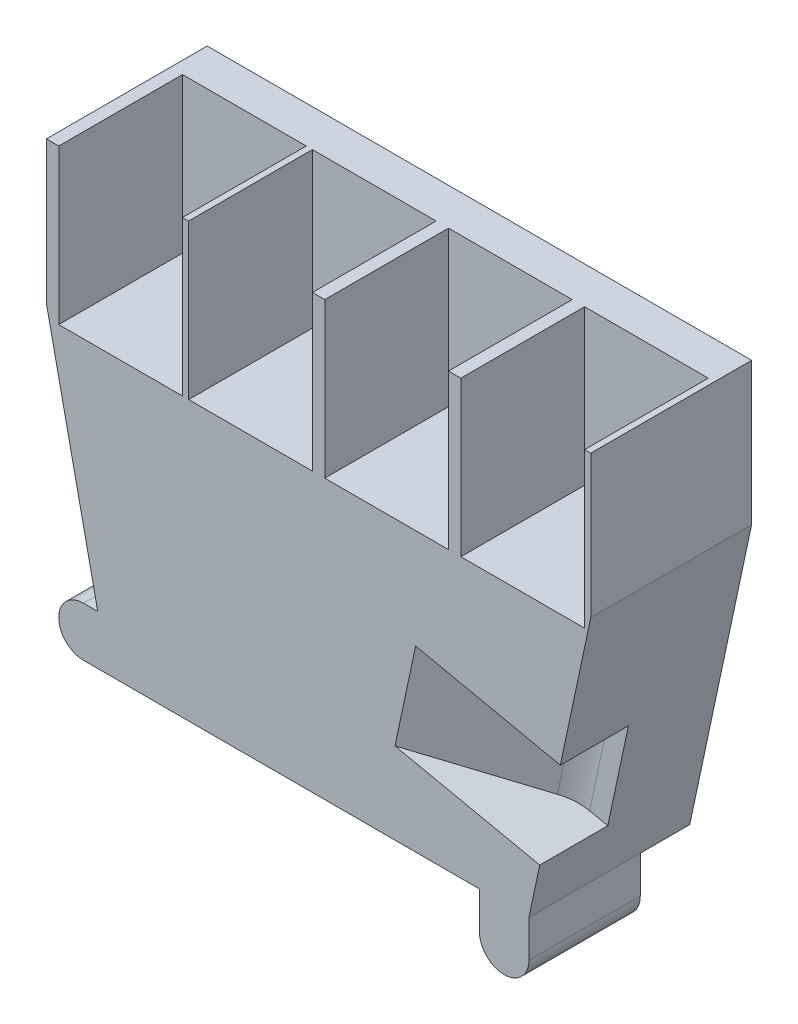
ISO-10303-21;
HEADER;
FILE_DESCRIPTION(('STEP AP214'),'2;1');
FILE_NAME('part.step','',(''),(''),'','','');
FILE_SCHEMA(('AUTOMOTIVE_DESIGN { 1 0 10303 214 1 1 1 1 }'));
ENDSEC;
DATA;
#1=APPLICATION_CONTEXT('core data for automotive mechanical design processes');
#2=APPLICATION_PROTOCOL_DEFINITION('international standard','automotive_design',2000,#1);
#3=PRODUCT_CONTEXT('',#1,'mechanical');
#4=PRODUCT('Part','Part','',(#3));
#5=PRODUCT_RELATED_PRODUCT_CATEGORY('part','',(#4));
#6=PRODUCT_DEFINITION_FORMATION('','',#4);
#7=PRODUCT_DEFINITION_CONTEXT('part definition',#1,'design');
#8=PRODUCT_DEFINITION('design','',#6,#7);
#9=PRODUCT_DEFINITION_SHAPE('','',#8);
#10=(LENGTH_UNIT() NAMED_UNIT(*) SI_UNIT(.MILLI.,.METRE.));
#11=(NAMED_UNIT(*) PLANE_ANGLE_UNIT() SI_UNIT($,.RADIAN.));
#12=(NAMED_UNIT(*) SI_UNIT($,.STERADIAN.) SOLID_ANGLE_UNIT());
#13=UNCERTAINTY_MEASURE_WITH_UNIT(LENGTH_MEASURE(1.E-05),#10,'distance_accuracy_value','');
#14=(GEOMETRIC_REPRESENTATION_CONTEXT(3) GLOBAL_UNCERTAINTY_ASSIGNED_CONTEXT((#13)) GLOBAL_UNIT_ASSIGNED_CONTEXT((#10,
#11,#12)) REPRESENTATION_CONTEXT('',''));
#15=CARTESIAN_POINT('',(0.,0.,0.));
#16=DIRECTION('',(0.,0.,1.));
#17=DIRECTION('',(1.,0.,0.));
#18=AXIS2_PLACEMENT_3D('',#15,#16,#17);
#19=CARTESIAN_POINT('',(26.,-24.,26.));
#20=DIRECTION('',(-1.,0.,0.));
#21=DIRECTION('',(0.,0.,1.));
#22=AXIS2_PLACEMENT_3D('',#19,#20,#21);
#23=PLANE('',#22);
#24=DIRECTION('',(0.,1.,0.));
#25=VECTOR('',#24,1.);
#26=CARTESIAN_POINT('',(26.,-24.,8.));
#27=LINE('',#26,#25);
#28=CARTESIAN_POINT('',(26.,-30.,8.));
#29=VERTEX_POINT('',#28);
#30=CARTESIAN_POINT('',(26.,-24.,8.));
#31=VERTEX_POINT('',#30);
#32=EDGE_CURVE('E419',#29,#31,#27,.T.);
#33=ORIENTED_EDGE('',*,*,#32,.F.);
#34=DIRECTION('',(0.,0.,-1.));
#35=VECTOR('',#34,1.);
#36=CARTESIAN_POINT('',(26.,-30.,26.));
#37=LINE('',#36,#35);
#38=CARTESIAN_POINT('',(26.,-30.,26.));
#39=VERTEX_POINT('',#38);
#40=EDGE_CURVE('E404',#39,#29,#37,.T.);
#41=ORIENTED_EDGE('',*,*,#40,.F.);
#42=DIRECTION('',(0.,1.,0.));
#43=VECTOR('',#42,1.);
#44=CARTESIAN_POINT('',(26.,-24.,26.));
#45=LINE('',#44,#43);
#46=CARTESIAN_POINT('',(26.,-24.,26.));
#47=VERTEX_POINT('',#46);
#48=EDGE_CURVE('E380',#39,#47,#45,.T.);
#49=ORIENTED_EDGE('',*,*,#48,.T.);
#50=DIRECTION('',(0.,0.,-1.));
#51=VECTOR('',#50,1.);
#52=CARTESIAN_POINT('',(26.,-24.,26.));
#53=LINE('',#52,#51);
#54=EDGE_CURVE('E375',#47,#31,#53,.T.);
#55=ORIENTED_EDGE('',*,*,#54,.T.);
#56=EDGE_LOOP('',(#33,#41,#49,#55));
#57=FACE_BOUND('',#56,.T.);
#58=ADVANCED_FACE('F40',(#57),#23,.T.);
#59=CARTESIAN_POINT('',(-34.,-24.,26.));
#60=DIRECTION('',(0.,1.,0.));
#61=DIRECTION('',(0.,0.,1.));
#62=AXIS2_PLACEMENT_3D('',#59,#60,#61);
#63=PLANE('',#62);
#64=DIRECTION('',(0.,0.,-1.));
#65=VECTOR('',#64,1.);
#66=CARTESIAN_POINT('',(-38.,-24.,26.));
#67=LINE('',#66,#65);
#68=CARTESIAN_POINT('',(-38.,-24.,26.));
#69=VERTEX_POINT('',#68);
#70=CARTESIAN_POINT('',(-38.,-24.,0.));
#71=VERTEX_POINT('',#70);
#72=EDGE_CURVE('E259',#69,#71,#67,.T.);
#73=ORIENTED_EDGE('',*,*,#72,.T.);
#74=DIRECTION('',(1.,0.,0.));
#75=VECTOR('',#74,1.);
#76=CARTESIAN_POINT('',(-34.,-24.,0.));
#77=LINE('',#76,#75);
#78=CARTESIAN_POINT('',(34.,-24.,0.));
#79=VERTEX_POINT('',#78);
#80=EDGE_CURVE('E253',#71,#79,#77,.T.);
#81=ORIENTED_EDGE('',*,*,#80,.T.);
#82=DIRECTION('',(0.,0.,1.));
#83=VECTOR('',#82,1.);
#84=CARTESIAN_POINT('',(34.,-24.,0.));
#85=LINE('',#84,#83);
#86=CARTESIAN_POINT('',(34.,-24.,8.));
#87=VERTEX_POINT('',#86);
#88=EDGE_CURVE('E257',#79,#87,#85,.T.);
#89=ORIENTED_EDGE('',*,*,#88,.T.);
#90=DIRECTION('',(1.,0.,0.));
#91=VECTOR('',#90,1.);
#92=CARTESIAN_POINT('',(-44.,-24.,8.));
#93=LINE('',#92,#91);
#94=EDGE_CURVE('E422',#31,#87,#93,.T.);
#95=ORIENTED_EDGE('',*,*,#94,.F.);
#96=ORIENTED_EDGE('',*,*,#54,.F.);
#97=DIRECTION('',(1.,0.,0.));
#98=VECTOR('',#97,1.);
#99=CARTESIAN_POINT('',(-34.,-24.,26.));
#100=LINE('',#99,#98);
#101=EDGE_CURVE('E597',#69,#47,#100,.T.);
#102=ORIENTED_EDGE('',*,*,#101,.F.);
#103=EDGE_LOOP('',(#73,#81,#89,#95,#96,#102));
#104=FACE_BOUND('',#103,.T.);
#105=ADVANCED_FACE('F255',(#104),#63,.F.);
#106=CARTESIAN_POINT('',(32.8135538420826,-15.1606804101311,22.999075159608));
#107=DIRECTION('',(0.208107644464858,0.978105928984836,0.));
#108=DIRECTION('',(-0.978105928984836,0.208107644464858,0.));
#109=AXIS2_PLACEMENT_3D('',#106,#107,#108);
#110=CYLINDRICAL_SURFACE('',#109,8.);
#111=DIRECTION('',(0.208107644464858,0.978105928984836,0.));
#112=VECTOR('',#111,1.);
#113=CARTESIAN_POINT('',(28.7579721450863,-14.2977906873236,16.1574614299926));
#114=LINE('',#113,#112);
#115=CARTESIAN_POINT('',(28.7579721450831,-14.2977906873381,16.1574614299927));
#116=VERTEX_POINT('',#115);
#117=CARTESIAN_POINT('',(32.0876944516157,1.35190417746291,16.157461433032));
#118=VERTEX_POINT('',#117);
#119=EDGE_CURVE('E49',#116,#118,#114,.T.);
#120=ORIENTED_EDGE('',*,*,#119,.F.);
#121=CARTESIAN_POINT('',(32.8135538420826,-15.1606804101311,22.999075159608));
#122=DIRECTION('',(0.208107644464858,0.978105928984836,6.86560183704721E-12));
#123=DIRECTION('',(-0.978105928984836,0.208107644464858,0.));
#124=AXIS2_PLACEMENT_3D('',#121,#122,#123);
#125=CIRCLE('',#124,8.);
#126=CARTESIAN_POINT('',(32.813553842094,-15.1606804100774,14.999075159608));
#127=VERTEX_POINT('',#126);
#128=EDGE_CURVE('E348',#127,#116,#125,.T.);
#129=ORIENTED_EDGE('',*,*,#128,.F.);
#130=DIRECTION('',(0.208107644464858,0.978105928984836,0.));
#131=VECTOR('',#130,1.);
#132=CARTESIAN_POINT('',(32.813553842094,-15.1606804100774,14.999075159608));
#133=LINE('',#132,#131);
#134=CARTESIAN_POINT('',(36.1432761535318,0.489014453679986,14.999075159608));
#135=VERTEX_POINT('',#134);
#136=EDGE_CURVE('E346',#127,#135,#133,.T.);
#137=ORIENTED_EDGE('',*,*,#136,.T.);
#138=CARTESIAN_POINT('',(36.1432761535203,0.489014453626261,22.999075159608));
#139=DIRECTION('',(0.208107644464858,0.978105928984836,6.86560183704721E-12));
#140=DIRECTION('',(-0.978105928984836,0.208107644464858,0.));
#141=AXIS2_PLACEMENT_3D('',#138,#139,#140);
#142=CIRCLE('',#141,8.);
#143=EDGE_CURVE('E338',#135,#118,#142,.T.);
#144=ORIENTED_EDGE('',*,*,#143,.T.);
#145=EDGE_LOOP('',(#120,#129,#137,#144));
#146=FACE_BOUND('',#145,.T.);
#147=ADVANCED_FACE('F344',(#146),#110,.F.);
#148=CARTESIAN_POINT('',(-44.,46.,26.));
#149=DIRECTION('',(1.,0.,0.));
#150=DIRECTION('',(0.,1.,0.));
#151=AXIS2_PLACEMENT_3D('',#148,#149,#150);
#152=PLANE('',#151);
#153=DIRECTION('',(0.,-1.,0.));
#154=VECTOR('',#153,1.);
#155=CARTESIAN_POINT('',(-44.,46.,0.));
#156=LINE('',#155,#154);
#157=CARTESIAN_POINT('',(-44.,46.,0.));
#158=VERTEX_POINT('',#157);
#159=CARTESIAN_POINT('',(-44.,23.,0.));
#160=VERTEX_POINT('',#159);
#161=EDGE_CURVE('E465',#158,#160,#156,.T.);
#162=ORIENTED_EDGE('',*,*,#161,.T.);
#163=DIRECTION('',(0.,0.,-1.));
#164=VECTOR('',#163,1.);
#165=CARTESIAN_POINT('',(-44.,23.,26.));
#166=LINE('',#165,#164);
#167=CARTESIAN_POINT('',(-44.,23.,26.));
#168=VERTEX_POINT('',#167);
#169=EDGE_CURVE('E306',#168,#160,#166,.T.);
#170=ORIENTED_EDGE('',*,*,#169,.F.);
#171=DIRECTION('',(0.,-1.,0.));
#172=VECTOR('',#171,1.);
#173=CARTESIAN_POINT('',(-44.,46.,26.));
#174=LINE('',#173,#172);
#175=CARTESIAN_POINT('',(-44.,46.,26.));
#176=VERTEX_POINT('',#175);
#177=EDGE_CURVE('E291',#176,#168,#174,.T.);
#178=ORIENTED_EDGE('',*,*,#177,.F.);
#179=DIRECTION('',(0.,0.,-1.));
#180=VECTOR('',#179,1.);
#181=CARTESIAN_POINT('',(-44.,46.,26.));
#182=LINE('',#181,#180);
#183=EDGE_CURVE('E292',#176,#158,#182,.T.);
#184=ORIENTED_EDGE('',*,*,#183,.T.);
#185=EDGE_LOOP('',(#162,#170,#178,#184));
#186=FACE_BOUND('',#185,.T.);
#187=ADVANCED_FACE('F42',(#186),#152,.F.);
#188=CARTESIAN_POINT('',(-44.,23.,26.));
#189=DIRECTION('',(0.978105928984836,0.208107644464859,0.));
#190=DIRECTION('',(-0.208107644464859,0.978105928984836,0.));
#191=AXIS2_PLACEMENT_3D('',#188,#189,#190);
#192=PLANE('',#191);
#193=DIRECTION('',(0.208107644464859,-0.978105928984835,0.));
#194=VECTOR('',#193,1.);
#195=CARTESIAN_POINT('',(-44.,23.,0.));
#196=LINE('',#195,#194);
#197=CARTESIAN_POINT('',(-35.7021276595745,-16.,0.));
#198=VERTEX_POINT('',#197);
#199=EDGE_CURVE('E266',#160,#198,#196,.T.);
#200=ORIENTED_EDGE('',*,*,#199,.T.);
#201=DIRECTION('',(0.,0.,1.));
#202=VECTOR('',#201,1.);
#203=CARTESIAN_POINT('',(-35.7021276595745,-16.,26.));
#204=LINE('',#203,#202);
#205=CARTESIAN_POINT('',(-35.7021276595745,-16.,26.));
#206=VERTEX_POINT('',#205);
#207=EDGE_CURVE('E387',#198,#206,#204,.T.);
#208=ORIENTED_EDGE('',*,*,#207,.T.);
#209=DIRECTION('',(0.208107644464859,-0.978105928984835,0.));
#210=VECTOR('',#209,1.);
#211=CARTESIAN_POINT('',(-44.,23.,26.));
#212=LINE('',#211,#210);
#213=EDGE_CURVE('E593',#168,#206,#212,.T.);
#214=ORIENTED_EDGE('',*,*,#213,.F.);
#215=ORIENTED_EDGE('',*,*,#169,.T.);
#216=EDGE_LOOP('',(#200,#208,#214,#215));
#217=FACE_BOUND('',#216,.T.);
#218=ADVANCED_FACE('F619',(#217),#192,.F.);
#219=CARTESIAN_POINT('',(34.,-24.,26.));
#220=DIRECTION('',(-0.978105928984836,0.208107644464858,0.));
#221=DIRECTION('',(-0.208107644464858,-0.978105928984836,0.));
#222=AXIS2_PLACEMENT_3D('',#219,#220,#221);
#223=PLANE('',#222);
#224=DIRECTION('',(0.208107644464858,0.978105928984836,0.));
#225=VECTOR('',#224,1.);
#226=CARTESIAN_POINT('',(34.,-24.,26.));
#227=LINE('',#226,#225);
#228=CARTESIAN_POINT('',(39.0775939404677,-0.13530847980171,26.));
#229=VERTEX_POINT('',#228);
#230=CARTESIAN_POINT('',(44.,23.,26.));
#231=VERTEX_POINT('',#230);
#232=EDGE_CURVE('E601',#229,#231,#227,.T.);
#233=ORIENTED_EDGE('',*,*,#232,.F.);
#234=DIRECTION('',(1.10229687708396E-12,5.1807953222946E-12,-1.));
#235=VECTOR('',#234,1.);
#236=CARTESIAN_POINT('',(39.0775939404677,-0.135308479801709,26.0000000001292));
#237=LINE('',#236,#235);
#238=CARTESIAN_POINT('',(39.0775939404863,-0.135308479714585,14.999075159608));
#239=VERTEX_POINT('',#238);
#240=EDGE_CURVE('E429',#229,#239,#237,.T.);
#241=ORIENTED_EDGE('',*,*,#240,.T.);
#242=DIRECTION('',(-0.208107644464858,-0.978105928984836,0.));
#243=VECTOR('',#242,1.);
#244=CARTESIAN_POINT('',(34.,-24.,14.999075159608));
#245=LINE('',#244,#243);
#246=CARTESIAN_POINT('',(35.7478716290485,-15.785003343472,14.999075159608));
#247=VERTEX_POINT('',#246);
#248=EDGE_CURVE('E316',#239,#247,#245,.T.);
#249=ORIENTED_EDGE('',*,*,#248,.T.);
#250=DIRECTION('',(1.10229687708396E-12,5.1807953222946E-12,-1.));
#251=VECTOR('',#250,1.);
#252=CARTESIAN_POINT('',(35.74787162903,-15.7850033435591,26.0000000000445));
#253=LINE('',#252,#251);
#254=CARTESIAN_POINT('',(35.74787162903,-15.7850033435591,26.));
#255=VERTEX_POINT('',#254);
#256=EDGE_CURVE('E352',#255,#247,#253,.T.);
#257=ORIENTED_EDGE('',*,*,#256,.F.);
#258=CARTESIAN_POINT('',(34.,-24.,26.));
#259=VERTEX_POINT('',#258);
#260=EDGE_CURVE('E602',#259,#255,#227,.T.);
#261=ORIENTED_EDGE('',*,*,#260,.F.);
#262=DIRECTION('',(0.,0.,-1.));
#263=VECTOR('',#262,1.);
#264=CARTESIAN_POINT('',(34.,-24.,26.));
#265=LINE('',#264,#263);
#266=EDGE_CURVE('E275',#259,#87,#265,.T.);
#267=ORIENTED_EDGE('',*,*,#266,.T.);
#268=ORIENTED_EDGE('',*,*,#88,.F.);
#269=DIRECTION('',(0.208107644464858,0.978105928984836,0.));
#270=VECTOR('',#269,1.);
#271=CARTESIAN_POINT('',(34.,-24.,0.));
#272=LINE('',#271,#270);
#273=CARTESIAN_POINT('',(44.,23.,0.));
#274=VERTEX_POINT('',#273);
#275=EDGE_CURVE('E265',#79,#274,#272,.T.);
#276=ORIENTED_EDGE('',*,*,#275,.T.);
#277=DIRECTION('',(0.,0.,-1.));
#278=VECTOR('',#277,1.);
#279=CARTESIAN_POINT('',(44.,23.,26.));
#280=LINE('',#279,#278);
#281=EDGE_CURVE('E301',#231,#274,#280,.T.);
#282=ORIENTED_EDGE('',*,*,#281,.F.);
#283=EDGE_LOOP('',(#233,#241,#249,#257,#261,#267,#268,#276,#282));
#284=FACE_BOUND('',#283,.T.);
#285=ADVANCED_FACE('F271',(#284),#223,.F.);
#286=CARTESIAN_POINT('',(44.,46.,26.));
#287=DIRECTION('',(-1.,0.,0.));
#288=DIRECTION('',(0.,-1.,0.));
#289=AXIS2_PLACEMENT_3D('',#286,#287,#288);
#290=PLANE('',#289);
#291=DIRECTION('',(0.,1.,0.));
#292=VECTOR('',#291,1.);
#293=CARTESIAN_POINT('',(44.,46.,0.));
#294=LINE('',#293,#292);
#295=CARTESIAN_POINT('',(44.,46.,0.));
#296=VERTEX_POINT('',#295);
#297=EDGE_CURVE('E281',#274,#296,#294,.T.);
#298=ORIENTED_EDGE('',*,*,#297,.T.);
#299=DIRECTION('',(0.,0.,-1.));
#300=VECTOR('',#299,1.);
#301=CARTESIAN_POINT('',(44.,46.,26.));
#302=LINE('',#301,#300);
#303=CARTESIAN_POINT('',(44.,46.,26.));
#304=VERTEX_POINT('',#303);
#305=EDGE_CURVE('E296',#304,#296,#302,.T.);
#306=ORIENTED_EDGE('',*,*,#305,.F.);
#307=DIRECTION('',(0.,1.,0.));
#308=VECTOR('',#307,1.);
#309=CARTESIAN_POINT('',(44.,46.,26.));
#310=LINE('',#309,#308);
#311=EDGE_CURVE('E606',#231,#304,#310,.T.);
#312=ORIENTED_EDGE('',*,*,#311,.F.);
#313=ORIENTED_EDGE('',*,*,#281,.T.);
#314=EDGE_LOOP('',(#298,#306,#312,#313));
#315=FACE_BOUND('',#314,.T.);
#316=ADVANCED_FACE('F643',(#315),#290,.F.);
#317=CARTESIAN_POINT('',(-44.,46.,26.));
#318=DIRECTION('',(0.,-1.,0.));
#319=DIRECTION('',(0.,0.,-1.));
#320=AXIS2_PLACEMENT_3D('',#317,#318,#319);
#321=PLANE('',#320);
#322=DIRECTION('',(-1.,0.,0.));
#323=VECTOR('',#322,1.);
#324=CARTESIAN_POINT('',(43.,46.,6.));
#325=LINE('',#324,#323);
#326=CARTESIAN_POINT('',(43.,46.,6.));
#327=VERTEX_POINT('',#326);
#328=CARTESIAN_POINT('',(23.,46.,6.));
#329=VERTEX_POINT('',#328);
#330=EDGE_CURVE('E455',#327,#329,#325,.T.);
#331=ORIENTED_EDGE('',*,*,#330,.F.);
#332=DIRECTION('',(0.,0.,-1.));
#333=VECTOR('',#332,1.);
#334=CARTESIAN_POINT('',(43.,46.,26.));
#335=LINE('',#334,#333);
#336=CARTESIAN_POINT('',(43.,46.,26.));
#337=VERTEX_POINT('',#336);
#338=EDGE_CURVE('E451',#337,#327,#335,.T.);
#339=ORIENTED_EDGE('',*,*,#338,.F.);
#340=DIRECTION('',(-1.,0.,0.));
#341=VECTOR('',#340,1.);
#342=CARTESIAN_POINT('',(-44.,46.,26.));
#343=LINE('',#342,#341);
#344=EDGE_CURVE('E297',#304,#337,#343,.T.);
#345=ORIENTED_EDGE('',*,*,#344,.F.);
#346=ORIENTED_EDGE('',*,*,#305,.T.);
#347=DIRECTION('',(-1.,0.,0.));
#348=VECTOR('',#347,1.);
#349=CARTESIAN_POINT('',(-44.,46.,0.));
#350=LINE('',#349,#348);
#351=EDGE_CURVE('E285',#296,#158,#350,.T.);
#352=ORIENTED_EDGE('',*,*,#351,.T.);
#353=ORIENTED_EDGE('',*,*,#183,.F.);
#354=CARTESIAN_POINT('',(-42.,46.,26.));
#355=VERTEX_POINT('',#354);
#356=EDGE_CURVE('E609',#355,#176,#343,.T.);
#357=ORIENTED_EDGE('',*,*,#356,.F.);
#358=DIRECTION('',(0.,0.,1.));
#359=VECTOR('',#358,1.);
#360=CARTESIAN_POINT('',(-42.,46.,26.));
#361=LINE('',#360,#359);
#362=CARTESIAN_POINT('',(-42.,46.,6.));
#363=VERTEX_POINT('',#362);
#364=EDGE_CURVE('E558',#363,#355,#361,.T.);
#365=ORIENTED_EDGE('',*,*,#364,.F.);
#366=DIRECTION('',(-1.,0.,0.));
#367=VECTOR('',#366,1.);
#368=CARTESIAN_POINT('',(-22.,46.,6.));
#369=LINE('',#368,#367);
#370=CARTESIAN_POINT('',(-22.,46.,6.));
#371=VERTEX_POINT('',#370);
#372=EDGE_CURVE('E573',#371,#363,#369,.T.);
#373=ORIENTED_EDGE('',*,*,#372,.F.);
#374=DIRECTION('',(0.,0.,-1.));
#375=VECTOR('',#374,1.);
#376=CARTESIAN_POINT('',(-22.,46.,26.));
#377=LINE('',#376,#375);
#378=CARTESIAN_POINT('',(-22.,46.,26.));
#379=VERTEX_POINT('',#378);
#380=EDGE_CURVE('E433',#379,#371,#377,.T.);
#381=ORIENTED_EDGE('',*,*,#380,.F.);
#382=CARTESIAN_POINT('',(-21.,46.,26.));
#383=VERTEX_POINT('',#382);
#384=EDGE_CURVE('E647',#383,#379,#343,.T.);
#385=ORIENTED_EDGE('',*,*,#384,.F.);
#386=DIRECTION('',(0.,0.,1.));
#387=VECTOR('',#386,1.);
#388=CARTESIAN_POINT('',(-21.,46.,26.));
#389=LINE('',#388,#387);
#390=CARTESIAN_POINT('',(-21.,46.,6.));
#391=VERTEX_POINT('',#390);
#392=EDGE_CURVE('E519',#391,#383,#389,.T.);
#393=ORIENTED_EDGE('',*,*,#392,.F.);
#394=DIRECTION('',(-1.,0.,0.));
#395=VECTOR('',#394,1.);
#396=CARTESIAN_POINT('',(-1.00000000000001,46.,6.));
#397=LINE('',#396,#395);
#398=CARTESIAN_POINT('',(-1.00000000000001,46.,6.));
#399=VERTEX_POINT('',#398);
#400=EDGE_CURVE('E535',#399,#391,#397,.T.);
#401=ORIENTED_EDGE('',*,*,#400,.F.);
#402=DIRECTION('',(0.,0.,-1.));
#403=VECTOR('',#402,1.);
#404=CARTESIAN_POINT('',(-1.00000000000001,46.,26.));
#405=LINE('',#404,#403);
#406=CARTESIAN_POINT('',(-1.00000000000001,46.,26.));
#407=VERTEX_POINT('',#406);
#408=EDGE_CURVE('E531',#407,#399,#405,.T.);
#409=ORIENTED_EDGE('',*,*,#408,.F.);
#410=CARTESIAN_POINT('',(0.999999999999987,46.,26.));
#411=VERTEX_POINT('',#410);
#412=EDGE_CURVE('E650',#411,#407,#343,.T.);
#413=ORIENTED_EDGE('',*,*,#412,.F.);
#414=DIRECTION('',(0.,0.,1.));
#415=VECTOR('',#414,1.);
#416=CARTESIAN_POINT('',(0.999999999999987,46.,26.));
#417=LINE('',#416,#415);
#418=CARTESIAN_POINT('',(0.999999999999987,46.,6.));
#419=VERTEX_POINT('',#418);
#420=EDGE_CURVE('E480',#419,#411,#417,.T.);
#421=ORIENTED_EDGE('',*,*,#420,.F.);
#422=DIRECTION('',(-1.,0.,0.));
#423=VECTOR('',#422,1.);
#424=CARTESIAN_POINT('',(21.,46.,6.));
#425=LINE('',#424,#423);
#426=CARTESIAN_POINT('',(21.,46.,6.));
#427=VERTEX_POINT('',#426);
#428=EDGE_CURVE('E496',#427,#419,#425,.T.);
#429=ORIENTED_EDGE('',*,*,#428,.F.);
#430=DIRECTION('',(0.,0.,-1.));
#431=VECTOR('',#430,1.);
#432=CARTESIAN_POINT('',(21.,46.,26.));
#433=LINE('',#432,#431);
#434=CARTESIAN_POINT('',(21.,46.,26.));
#435=VERTEX_POINT('',#434);
#436=EDGE_CURVE('E492',#435,#427,#433,.T.);
#437=ORIENTED_EDGE('',*,*,#436,.F.);
#438=CARTESIAN_POINT('',(23.,46.,26.));
#439=VERTEX_POINT('',#438);
#440=EDGE_CURVE('E613',#439,#435,#343,.T.);
#441=ORIENTED_EDGE('',*,*,#440,.F.);
#442=DIRECTION('',(0.,0.,1.));
#443=VECTOR('',#442,1.);
#444=CARTESIAN_POINT('',(23.,46.,26.));
#445=LINE('',#444,#443);
#446=EDGE_CURVE('E439',#329,#439,#445,.T.);
#447=ORIENTED_EDGE('',*,*,#446,.F.);
#448=EDGE_LOOP('',(#331,#339,#345,#346,#352,#353,#357,#365,#373,#381,#385,#393,#401,#409,#413,
#421,#429,#437,#441,#447));
#449=FACE_BOUND('',#448,.T.);
#450=ADVANCED_FACE('F637',(#449),#321,.F.);
#451=CARTESIAN_POINT('',(0.,0.,26.));
#452=DIRECTION('',(0.,0.,1.));
#453=DIRECTION('',(1.,0.,0.));
#454=AXIS2_PLACEMENT_3D('',#451,#452,#453);
#455=PLANE('',#454);
#456=CARTESIAN_POINT('',(30.,-30.,26.));
#457=DIRECTION('',(0.,0.,1.));
#458=DIRECTION('',(-1.,0.,0.));
#459=AXIS2_PLACEMENT_3D('',#456,#457,#458);
#460=CIRCLE('',#459,4.);
#461=CARTESIAN_POINT('',(34.,-30.,26.));
#462=VERTEX_POINT('',#461);
#463=EDGE_CURVE('E63',#39,#462,#460,.T.);
#464=ORIENTED_EDGE('',*,*,#463,.T.);
#465=DIRECTION('',(0.,-1.,0.));
#466=VECTOR('',#465,1.);
#467=CARTESIAN_POINT('',(34.,-24.,26.));
#468=LINE('',#467,#466);
#469=EDGE_CURVE('E383',#259,#462,#468,.T.);
#470=ORIENTED_EDGE('',*,*,#469,.F.);
#471=ORIENTED_EDGE('',*,*,#260,.T.);
#472=DIRECTION('',(-0.978105928984586,0.208107644466032,0.));
#473=VECTOR('',#472,1.);
#474=CARTESIAN_POINT('',(-1.66486115572516,-7.82484743186214,26.));
#475=LINE('',#474,#473);
#476=CARTESIAN_POINT('',(12.3549028544952,-10.8077759446926,26.0000000000714));
#477=VERTEX_POINT('',#476);
#478=EDGE_CURVE('E310',#255,#477,#475,.T.);
#479=ORIENTED_EDGE('',*,*,#478,.T.);
#480=DIRECTION('',(-0.208107644466032,-0.978105928984586,-5.29676302818416E-12));
#481=VECTOR('',#480,1.);
#482=CARTESIAN_POINT('',(15.6846251659517,4.8419189190608,26.0000000001562));
#483=LINE('',#482,#481);
#484=CARTESIAN_POINT('',(15.6846251659517,4.8419189190608,26.0000000001562));
#485=VERTEX_POINT('',#484);
#486=EDGE_CURVE('E341',#485,#477,#483,.T.);
#487=ORIENTED_EDGE('',*,*,#486,.F.);
#488=DIRECTION('',(-0.978105928984586,0.208107644466032,0.));
#489=VECTOR('',#488,1.);
#490=CARTESIAN_POINT('',(1.66486115573135,7.82484743189123,26.));
#491=LINE('',#490,#489);
#492=EDGE_CURVE('E313',#229,#485,#491,.T.);
#493=ORIENTED_EDGE('',*,*,#492,.F.);
#494=ORIENTED_EDGE('',*,*,#232,.T.);
#495=ORIENTED_EDGE('',*,*,#311,.T.);
#496=ORIENTED_EDGE('',*,*,#344,.T.);
#497=DIRECTION('',(0.,1.,0.));
#498=VECTOR('',#497,1.);
#499=CARTESIAN_POINT('',(43.,21.,26.));
#500=LINE('',#499,#498);
#501=CARTESIAN_POINT('',(43.,21.,26.));
#502=VERTEX_POINT('',#501);
#503=EDGE_CURVE('E462',#502,#337,#500,.T.);
#504=ORIENTED_EDGE('',*,*,#503,.F.);
#505=DIRECTION('',(1.,0.,0.));
#506=VECTOR('',#505,1.);
#507=CARTESIAN_POINT('',(43.,21.,26.));
#508=LINE('',#507,#506);
#509=CARTESIAN_POINT('',(23.,21.,26.));
#510=VERTEX_POINT('',#509);
#511=EDGE_CURVE('E446',#510,#502,#508,.T.);
#512=ORIENTED_EDGE('',*,*,#511,.F.);
#513=DIRECTION('',(0.,1.,0.));
#514=VECTOR('',#513,1.);
#515=CARTESIAN_POINT('',(23.,21.,26.));
#516=LINE('',#515,#514);
#517=EDGE_CURVE('E466',#510,#439,#516,.T.);
#518=ORIENTED_EDGE('',*,*,#517,.T.);
#519=ORIENTED_EDGE('',*,*,#440,.T.);
#520=DIRECTION('',(0.,1.,0.));
#521=VECTOR('',#520,1.);
#522=CARTESIAN_POINT('',(21.,21.,26.));
#523=LINE('',#522,#521);
#524=CARTESIAN_POINT('',(21.,21.,26.));
#525=VERTEX_POINT('',#524);
#526=EDGE_CURVE('E456',#525,#435,#523,.T.);
#527=ORIENTED_EDGE('',*,*,#526,.F.);
#528=DIRECTION('',(1.,0.,0.));
#529=VECTOR('',#528,1.);
#530=CARTESIAN_POINT('',(21.,21.,26.));
#531=LINE('',#530,#529);
#532=CARTESIAN_POINT('',(0.999999999999987,21.,26.));
#533=VERTEX_POINT('',#532);
#534=EDGE_CURVE('E487',#533,#525,#531,.T.);
#535=ORIENTED_EDGE('',*,*,#534,.F.);
#536=DIRECTION('',(0.,1.,0.));
#537=VECTOR('',#536,1.);
#538=CARTESIAN_POINT('',(0.999999999999987,21.,26.));
#539=LINE('',#538,#537);
#540=EDGE_CURVE('E505',#533,#411,#539,.T.);
#541=ORIENTED_EDGE('',*,*,#540,.T.);
#542=ORIENTED_EDGE('',*,*,#412,.T.);
#543=DIRECTION('',(0.,1.,0.));
#544=VECTOR('',#543,1.);
#545=CARTESIAN_POINT('',(-1.00000000000001,21.,26.));
#546=LINE('',#545,#544);
#547=CARTESIAN_POINT('',(-1.00000000000001,21.,26.));
#548=VERTEX_POINT('',#547);
#549=EDGE_CURVE('E497',#548,#407,#546,.T.);
#550=ORIENTED_EDGE('',*,*,#549,.F.);
#551=DIRECTION('',(1.,0.,0.));
#552=VECTOR('',#551,1.);
#553=CARTESIAN_POINT('',(-1.00000000000001,21.,26.));
#554=LINE('',#553,#552);
#555=CARTESIAN_POINT('',(-21.,21.,26.));
#556=VERTEX_POINT('',#555);
#557=EDGE_CURVE('E526',#556,#548,#554,.T.);
#558=ORIENTED_EDGE('',*,*,#557,.F.);
#559=DIRECTION('',(0.,1.,0.));
#560=VECTOR('',#559,1.);
#561=CARTESIAN_POINT('',(-21.,21.,26.));
#562=LINE('',#561,#560);
#563=EDGE_CURVE('E544',#556,#383,#562,.T.);
#564=ORIENTED_EDGE('',*,*,#563,.T.);
#565=ORIENTED_EDGE('',*,*,#384,.T.);
#566=DIRECTION('',(0.,1.,0.));
#567=VECTOR('',#566,1.);
#568=CARTESIAN_POINT('',(-22.,21.,26.));
#569=LINE('',#568,#567);
#570=CARTESIAN_POINT('',(-22.,21.,26.));
#571=VERTEX_POINT('',#570);
#572=EDGE_CURVE('E536',#571,#379,#569,.T.);
#573=ORIENTED_EDGE('',*,*,#572,.F.);
#574=DIRECTION('',(1.,0.,0.));
#575=VECTOR('',#574,1.);
#576=CARTESIAN_POINT('',(-22.,21.,26.));
#577=LINE('',#576,#575);
#578=CARTESIAN_POINT('',(-42.,21.,26.));
#579=VERTEX_POINT('',#578);
#580=EDGE_CURVE('E565',#579,#571,#577,.T.);
#581=ORIENTED_EDGE('',*,*,#580,.F.);
#582=DIRECTION('',(0.,1.,0.));
#583=VECTOR('',#582,1.);
#584=CARTESIAN_POINT('',(-42.,21.,26.));
#585=LINE('',#584,#583);
#586=EDGE_CURVE('E581',#579,#355,#585,.T.);
#587=ORIENTED_EDGE('',*,*,#586,.T.);
#588=ORIENTED_EDGE('',*,*,#356,.T.);
#589=ORIENTED_EDGE('',*,*,#177,.T.);
#590=ORIENTED_EDGE('',*,*,#213,.T.);
#591=DIRECTION('',(1.,0.,0.));
#592=VECTOR('',#591,1.);
#593=CARTESIAN_POINT('',(-34.,-16.,26.));
#594=LINE('',#593,#592);
#595=CARTESIAN_POINT('',(-38.,-16.,26.));
#596=VERTEX_POINT('',#595);
#597=EDGE_CURVE('E393',#596,#206,#594,.T.);
#598=ORIENTED_EDGE('',*,*,#597,.F.);
#599=CARTESIAN_POINT('',(-38.,-20.,26.));
#600=DIRECTION('',(0.,0.,-1.));
#601=DIRECTION('',(-1.,0.,0.));
#602=AXIS2_PLACEMENT_3D('',#599,#600,#601);
#603=CIRCLE('',#602,4.);
#604=EDGE_CURVE('E400',#69,#596,#603,.T.);
#605=ORIENTED_EDGE('',*,*,#604,.F.);
#606=ORIENTED_EDGE('',*,*,#101,.T.);
#607=ORIENTED_EDGE('',*,*,#48,.F.);
#608=EDGE_LOOP('',(#464,#470,#471,#479,#487,#493,#494,#495,#496,#504,#512,#518,#519,#527,#535,
#541,#542,#550,#558,#564,#565,#573,#581,#587,#588,#589,#590,#598,#605,#606,#607));
#609=FACE_BOUND('',#608,.T.);
#610=ADVANCED_FACE('F630',(#609),#455,.T.);
#611=CARTESIAN_POINT('',(0.,0.,0.));
#612=DIRECTION('',(0.,0.,1.));
#613=DIRECTION('',(1.,0.,0.));
#614=AXIS2_PLACEMENT_3D('',#611,#612,#613);
#615=PLANE('',#614);
#616=ORIENTED_EDGE('',*,*,#275,.F.);
#617=ORIENTED_EDGE('',*,*,#80,.F.);
#618=CARTESIAN_POINT('',(-38.,-20.,0.));
#619=DIRECTION('',(0.,0.,-1.));
#620=DIRECTION('',(-1.,0.,0.));
#621=AXIS2_PLACEMENT_3D('',#618,#619,#620);
#622=CIRCLE('',#621,4.);
#623=CARTESIAN_POINT('',(-38.,-16.,0.));
#624=VERTEX_POINT('',#623);
#625=EDGE_CURVE('E401',#71,#624,#622,.T.);
#626=ORIENTED_EDGE('',*,*,#625,.T.);
#627=DIRECTION('',(1.,0.,0.));
#628=VECTOR('',#627,1.);
#629=CARTESIAN_POINT('',(-34.,-16.,0.));
#630=LINE('',#629,#628);
#631=EDGE_CURVE('E396',#624,#198,#630,.T.);
#632=ORIENTED_EDGE('',*,*,#631,.T.);
#633=ORIENTED_EDGE('',*,*,#199,.F.);
#634=ORIENTED_EDGE('',*,*,#161,.F.);
#635=ORIENTED_EDGE('',*,*,#351,.F.);
#636=ORIENTED_EDGE('',*,*,#297,.F.);
#637=EDGE_LOOP('',(#616,#617,#626,#632,#633,#634,#635,#636));
#638=FACE_BOUND('',#637,.T.);
#639=ADVANCED_FACE('F279',(#638),#615,.F.);
#640=CARTESIAN_POINT('',(-22.,21.,26.));
#641=DIRECTION('',(1.,0.,0.));
#642=DIRECTION('',(0.,0.,-1.));
#643=AXIS2_PLACEMENT_3D('',#640,#641,#642);
#644=PLANE('',#643);
#645=ORIENTED_EDGE('',*,*,#380,.T.);
#646=DIRECTION('',(0.,1.,0.));
#647=VECTOR('',#646,1.);
#648=CARTESIAN_POINT('',(-22.,21.,6.));
#649=LINE('',#648,#647);
#650=CARTESIAN_POINT('',(-22.,21.,6.));
#651=VERTEX_POINT('',#650);
#652=EDGE_CURVE('E569',#651,#371,#649,.T.);
#653=ORIENTED_EDGE('',*,*,#652,.F.);
#654=DIRECTION('',(0.,0.,-1.));
#655=VECTOR('',#654,1.);
#656=CARTESIAN_POINT('',(-22.,21.,26.));
#657=LINE('',#656,#655);
#658=EDGE_CURVE('E553',#571,#651,#657,.T.);
#659=ORIENTED_EDGE('',*,*,#658,.F.);
#660=ORIENTED_EDGE('',*,*,#572,.T.);
#661=EDGE_LOOP('',(#645,#653,#659,#660));
#662=FACE_BOUND('',#661,.T.);
#663=ADVANCED_FACE('F692',(#662),#644,.F.);
#664=CARTESIAN_POINT('',(-42.,21.,26.));
#665=DIRECTION('',(-1.,0.,0.));
#666=DIRECTION('',(0.,0.,1.));
#667=AXIS2_PLACEMENT_3D('',#664,#665,#666);
#668=PLANE('',#667);
#669=ORIENTED_EDGE('',*,*,#364,.T.);
#670=ORIENTED_EDGE('',*,*,#586,.F.);
#671=DIRECTION('',(0.,0.,1.));
#672=VECTOR('',#671,1.);
#673=CARTESIAN_POINT('',(-42.,21.,26.));
#674=LINE('',#673,#672);
#675=CARTESIAN_POINT('',(-42.,21.,6.));
#676=VERTEX_POINT('',#675);
#677=EDGE_CURVE('E562',#676,#579,#674,.T.);
#678=ORIENTED_EDGE('',*,*,#677,.F.);
#679=DIRECTION('',(0.,1.,0.));
#680=VECTOR('',#679,1.);
#681=CARTESIAN_POINT('',(-42.,21.,6.));
#682=LINE('',#681,#680);
#683=EDGE_CURVE('E585',#676,#363,#682,.T.);
#684=ORIENTED_EDGE('',*,*,#683,.T.);
#685=EDGE_LOOP('',(#669,#670,#678,#684));
#686=FACE_BOUND('',#685,.T.);
#687=ADVANCED_FACE('F699',(#686),#668,.F.);
#688=CARTESIAN_POINT('',(-22.,21.,6.));
#689=DIRECTION('',(0.,0.,-1.));
#690=DIRECTION('',(-1.,0.,0.));
#691=AXIS2_PLACEMENT_3D('',#688,#689,#690);
#692=PLANE('',#691);
#693=ORIENTED_EDGE('',*,*,#372,.T.);
#694=ORIENTED_EDGE('',*,*,#683,.F.);
#695=DIRECTION('',(-1.,0.,0.));
#696=VECTOR('',#695,1.);
#697=CARTESIAN_POINT('',(-22.,21.,6.));
#698=LINE('',#697,#696);
#699=EDGE_CURVE('E557',#651,#676,#698,.T.);
#700=ORIENTED_EDGE('',*,*,#699,.F.);
#701=ORIENTED_EDGE('',*,*,#652,.T.);
#702=EDGE_LOOP('',(#693,#694,#700,#701));
#703=FACE_BOUND('',#702,.T.);
#704=ADVANCED_FACE('F702',(#703),#692,.F.);
#705=CARTESIAN_POINT('',(0.,21.,0.));
#706=DIRECTION('',(0.,1.,0.));
#707=DIRECTION('',(0.,0.,1.));
#708=AXIS2_PLACEMENT_3D('',#705,#706,#707);
#709=PLANE('',#708);
#710=ORIENTED_EDGE('',*,*,#658,.T.);
#711=ORIENTED_EDGE('',*,*,#699,.T.);
#712=ORIENTED_EDGE('',*,*,#677,.T.);
#713=ORIENTED_EDGE('',*,*,#580,.T.);
#714=EDGE_LOOP('',(#710,#711,#712,#713));
#715=FACE_BOUND('',#714,.T.);
#716=ADVANCED_FACE('F695',(#715),#709,.T.);
#717=CARTESIAN_POINT('',(-1.00000000000001,21.,26.));
#718=DIRECTION('',(1.,0.,0.));
#719=DIRECTION('',(0.,0.,-1.));
#720=AXIS2_PLACEMENT_3D('',#717,#718,#719);
#721=PLANE('',#720);
#722=ORIENTED_EDGE('',*,*,#408,.T.);
#723=DIRECTION('',(0.,1.,0.));
#724=VECTOR('',#723,1.);
#725=CARTESIAN_POINT('',(-1.00000000000001,21.,6.));
#726=LINE('',#725,#724);
#727=CARTESIAN_POINT('',(-1.00000000000001,21.,6.));
#728=VERTEX_POINT('',#727);
#729=EDGE_CURVE('E530',#728,#399,#726,.T.);
#730=ORIENTED_EDGE('',*,*,#729,.F.);
#731=DIRECTION('',(0.,0.,-1.));
#732=VECTOR('',#731,1.);
#733=CARTESIAN_POINT('',(-1.00000000000001,21.,26.));
#734=LINE('',#733,#732);
#735=EDGE_CURVE('E514',#548,#728,#734,.T.);
#736=ORIENTED_EDGE('',*,*,#735,.F.);
#737=ORIENTED_EDGE('',*,*,#549,.T.);
#738=EDGE_LOOP('',(#722,#730,#736,#737));
#739=FACE_BOUND('',#738,.T.);
#740=ADVANCED_FACE('F677',(#739),#721,.F.);
#741=CARTESIAN_POINT('',(-21.,21.,26.));
#742=DIRECTION('',(-1.,0.,0.));
#743=DIRECTION('',(0.,0.,1.));
#744=AXIS2_PLACEMENT_3D('',#741,#742,#743);
#745=PLANE('',#744);
#746=ORIENTED_EDGE('',*,*,#392,.T.);
#747=ORIENTED_EDGE('',*,*,#563,.F.);
#748=DIRECTION('',(0.,0.,1.));
#749=VECTOR('',#748,1.);
#750=CARTESIAN_POINT('',(-21.,21.,26.));
#751=LINE('',#750,#749);
#752=CARTESIAN_POINT('',(-21.,21.,6.));
#753=VERTEX_POINT('',#752);
#754=EDGE_CURVE('E523',#753,#556,#751,.T.);
#755=ORIENTED_EDGE('',*,*,#754,.F.);
#756=DIRECTION('',(0.,1.,0.));
#757=VECTOR('',#756,1.);
#758=CARTESIAN_POINT('',(-21.,21.,6.));
#759=LINE('',#758,#757);
#760=EDGE_CURVE('E548',#753,#391,#759,.T.);
#761=ORIENTED_EDGE('',*,*,#760,.T.);
#762=EDGE_LOOP('',(#746,#747,#755,#761));
#763=FACE_BOUND('',#762,.T.);
#764=ADVANCED_FACE('F686',(#763),#745,.F.);
#765=CARTESIAN_POINT('',(-1.00000000000001,21.,6.));
#766=DIRECTION('',(0.,0.,-1.));
#767=DIRECTION('',(-1.,0.,0.));
#768=AXIS2_PLACEMENT_3D('',#765,#766,#767);
#769=PLANE('',#768);
#770=ORIENTED_EDGE('',*,*,#400,.T.);
#771=ORIENTED_EDGE('',*,*,#760,.F.);
#772=DIRECTION('',(-1.,0.,0.));
#773=VECTOR('',#772,1.);
#774=CARTESIAN_POINT('',(-1.00000000000001,21.,6.));
#775=LINE('',#774,#773);
#776=EDGE_CURVE('E518',#728,#753,#775,.T.);
#777=ORIENTED_EDGE('',*,*,#776,.F.);
#778=ORIENTED_EDGE('',*,*,#729,.T.);
#779=EDGE_LOOP('',(#770,#771,#777,#778));
#780=FACE_BOUND('',#779,.T.);
#781=ADVANCED_FACE('F769',(#780),#769,.F.);
#782=CARTESIAN_POINT('',(0.,21.,0.));
#783=DIRECTION('',(0.,1.,0.));
#784=DIRECTION('',(0.,0.,1.));
#785=AXIS2_PLACEMENT_3D('',#782,#783,#784);
#786=PLANE('',#785);
#787=ORIENTED_EDGE('',*,*,#735,.T.);
#788=ORIENTED_EDGE('',*,*,#776,.T.);
#789=ORIENTED_EDGE('',*,*,#754,.T.);
#790=ORIENTED_EDGE('',*,*,#557,.T.);
#791=EDGE_LOOP('',(#787,#788,#789,#790));
#792=FACE_BOUND('',#791,.T.);
#793=ADVANCED_FACE('F683',(#792),#786,.T.);
#794=CARTESIAN_POINT('',(21.,21.,26.));
#795=DIRECTION('',(1.,0.,0.));
#796=DIRECTION('',(0.,0.,-1.));
#797=AXIS2_PLACEMENT_3D('',#794,#795,#796);
#798=PLANE('',#797);
#799=ORIENTED_EDGE('',*,*,#436,.T.);
#800=DIRECTION('',(0.,1.,0.));
#801=VECTOR('',#800,1.);
#802=CARTESIAN_POINT('',(21.,21.,6.));
#803=LINE('',#802,#801);
#804=CARTESIAN_POINT('',(21.,21.,6.));
#805=VERTEX_POINT('',#804);
#806=EDGE_CURVE('E491',#805,#427,#803,.T.);
#807=ORIENTED_EDGE('',*,*,#806,.F.);
#808=DIRECTION('',(0.,0.,-1.));
#809=VECTOR('',#808,1.);
#810=CARTESIAN_POINT('',(21.,21.,26.));
#811=LINE('',#810,#809);
#812=EDGE_CURVE('E475',#525,#805,#811,.T.);
#813=ORIENTED_EDGE('',*,*,#812,.F.);
#814=ORIENTED_EDGE('',*,*,#526,.T.);
#815=EDGE_LOOP('',(#799,#807,#813,#814));
#816=FACE_BOUND('',#815,.T.);
#817=ADVANCED_FACE('F664',(#816),#798,.F.);
#818=CARTESIAN_POINT('',(0.999999999999987,21.,26.));
#819=DIRECTION('',(-1.,0.,0.));
#820=DIRECTION('',(0.,0.,1.));
#821=AXIS2_PLACEMENT_3D('',#818,#819,#820);
#822=PLANE('',#821);
#823=ORIENTED_EDGE('',*,*,#420,.T.);
#824=ORIENTED_EDGE('',*,*,#540,.F.);
#825=DIRECTION('',(0.,0.,1.));
#826=VECTOR('',#825,1.);
#827=CARTESIAN_POINT('',(0.999999999999987,21.,26.));
#828=LINE('',#827,#826);
#829=CARTESIAN_POINT('',(0.999999999999987,21.,6.));
#830=VERTEX_POINT('',#829);
#831=EDGE_CURVE('E484',#830,#533,#828,.T.);
#832=ORIENTED_EDGE('',*,*,#831,.F.);
#833=DIRECTION('',(0.,1.,0.));
#834=VECTOR('',#833,1.);
#835=CARTESIAN_POINT('',(0.999999999999987,21.,6.));
#836=LINE('',#835,#834);
#837=EDGE_CURVE('E509',#830,#419,#836,.T.);
#838=ORIENTED_EDGE('',*,*,#837,.T.);
#839=EDGE_LOOP('',(#823,#824,#832,#838));
#840=FACE_BOUND('',#839,.T.);
#841=ADVANCED_FACE('F759',(#840),#822,.F.);
#842=CARTESIAN_POINT('',(21.,21.,6.));
#843=DIRECTION('',(0.,0.,-1.));
#844=DIRECTION('',(-1.,0.,0.));
#845=AXIS2_PLACEMENT_3D('',#842,#843,#844);
#846=PLANE('',#845);
#847=ORIENTED_EDGE('',*,*,#428,.T.);
#848=ORIENTED_EDGE('',*,*,#837,.F.);
#849=DIRECTION('',(-1.,0.,0.));
#850=VECTOR('',#849,1.);
#851=CARTESIAN_POINT('',(21.,21.,6.));
#852=LINE('',#851,#850);
#853=EDGE_CURVE('E479',#805,#830,#852,.T.);
#854=ORIENTED_EDGE('',*,*,#853,.F.);
#855=ORIENTED_EDGE('',*,*,#806,.T.);
#856=EDGE_LOOP('',(#847,#848,#854,#855));
#857=FACE_BOUND('',#856,.T.);
#858=ADVANCED_FACE('F758',(#857),#846,.F.);
#859=CARTESIAN_POINT('',(0.,21.,0.));
#860=DIRECTION('',(0.,1.,0.));
#861=DIRECTION('',(0.,0.,1.));
#862=AXIS2_PLACEMENT_3D('',#859,#860,#861);
#863=PLANE('',#862);
#864=ORIENTED_EDGE('',*,*,#812,.T.);
#865=ORIENTED_EDGE('',*,*,#853,.T.);
#866=ORIENTED_EDGE('',*,*,#831,.T.);
#867=ORIENTED_EDGE('',*,*,#534,.T.);
#868=EDGE_LOOP('',(#864,#865,#866,#867));
#869=FACE_BOUND('',#868,.T.);
#870=ADVANCED_FACE('F667',(#869),#863,.T.);
#871=CARTESIAN_POINT('',(43.,21.,26.));
#872=DIRECTION('',(1.,0.,0.));
#873=DIRECTION('',(0.,0.,-1.));
#874=AXIS2_PLACEMENT_3D('',#871,#872,#873);
#875=PLANE('',#874);
#876=ORIENTED_EDGE('',*,*,#338,.T.);
#877=DIRECTION('',(0.,1.,0.));
#878=VECTOR('',#877,1.);
#879=CARTESIAN_POINT('',(43.,21.,6.));
#880=LINE('',#879,#878);
#881=CARTESIAN_POINT('',(43.,21.,6.));
#882=VERTEX_POINT('',#881);
#883=EDGE_CURVE('E450',#882,#327,#880,.T.);
#884=ORIENTED_EDGE('',*,*,#883,.F.);
#885=DIRECTION('',(0.,0.,-1.));
#886=VECTOR('',#885,1.);
#887=CARTESIAN_POINT('',(43.,21.,26.));
#888=LINE('',#887,#886);
#889=EDGE_CURVE('E434',#502,#882,#888,.T.);
#890=ORIENTED_EDGE('',*,*,#889,.F.);
#891=ORIENTED_EDGE('',*,*,#503,.T.);
#892=EDGE_LOOP('',(#876,#884,#890,#891));
#893=FACE_BOUND('',#892,.T.);
#894=ADVANCED_FACE('F748',(#893),#875,.F.);
#895=CARTESIAN_POINT('',(23.,21.,26.));
#896=DIRECTION('',(-1.,0.,0.));
#897=DIRECTION('',(0.,0.,1.));
#898=AXIS2_PLACEMENT_3D('',#895,#896,#897);
#899=PLANE('',#898);
#900=ORIENTED_EDGE('',*,*,#446,.T.);
#901=ORIENTED_EDGE('',*,*,#517,.F.);
#902=DIRECTION('',(0.,0.,1.));
#903=VECTOR('',#902,1.);
#904=CARTESIAN_POINT('',(23.,21.,26.));
#905=LINE('',#904,#903);
#906=CARTESIAN_POINT('',(23.,21.,6.));
#907=VERTEX_POINT('',#906);
#908=EDGE_CURVE('E443',#907,#510,#905,.T.);
#909=ORIENTED_EDGE('',*,*,#908,.F.);
#910=DIRECTION('',(0.,1.,0.));
#911=VECTOR('',#910,1.);
#912=CARTESIAN_POINT('',(23.,21.,6.));
#913=LINE('',#912,#911);
#914=EDGE_CURVE('E470',#907,#329,#913,.T.);
#915=ORIENTED_EDGE('',*,*,#914,.T.);
#916=EDGE_LOOP('',(#900,#901,#909,#915));
#917=FACE_BOUND('',#916,.T.);
#918=ADVANCED_FACE('F745',(#917),#899,.F.);
#919=CARTESIAN_POINT('',(43.,21.,6.));
#920=DIRECTION('',(0.,0.,-1.));
#921=DIRECTION('',(-1.,0.,0.));
#922=AXIS2_PLACEMENT_3D('',#919,#920,#921);
#923=PLANE('',#922);
#924=ORIENTED_EDGE('',*,*,#330,.T.);
#925=ORIENTED_EDGE('',*,*,#914,.F.);
#926=DIRECTION('',(-1.,0.,0.));
#927=VECTOR('',#926,1.);
#928=CARTESIAN_POINT('',(43.,21.,6.));
#929=LINE('',#928,#927);
#930=EDGE_CURVE('E438',#882,#907,#929,.T.);
#931=ORIENTED_EDGE('',*,*,#930,.F.);
#932=ORIENTED_EDGE('',*,*,#883,.T.);
#933=EDGE_LOOP('',(#924,#925,#931,#932));
#934=FACE_BOUND('',#933,.T.);
#935=ADVANCED_FACE('F743',(#934),#923,.F.);
#936=CARTESIAN_POINT('',(0.,21.,0.));
#937=DIRECTION('',(0.,1.,0.));
#938=DIRECTION('',(0.,0.,1.));
#939=AXIS2_PLACEMENT_3D('',#936,#937,#938);
#940=PLANE('',#939);
#941=ORIENTED_EDGE('',*,*,#889,.T.);
#942=ORIENTED_EDGE('',*,*,#930,.T.);
#943=ORIENTED_EDGE('',*,*,#908,.T.);
#944=ORIENTED_EDGE('',*,*,#511,.T.);
#945=EDGE_LOOP('',(#941,#942,#943,#944));
#946=FACE_BOUND('',#945,.T.);
#947=ADVANCED_FACE('F733',(#946),#940,.T.);
#948=CARTESIAN_POINT('',(32.813553842094,-15.1606804100774,14.999075159608));
#949=DIRECTION('',(0.,0.,-1.));
#950=DIRECTION('',(-1.,0.,0.));
#951=AXIS2_PLACEMENT_3D('',#948,#949,#950);
#952=PLANE('',#951);
#953=DIRECTION('',(-0.978105928984836,0.208107644464858,0.));
#954=VECTOR('',#953,1.);
#955=CARTESIAN_POINT('',(36.1432761535318,0.489014453679985,14.999075159608));
#956=LINE('',#955,#954);
#957=EDGE_CURVE('E365',#239,#135,#956,.T.);
#958=ORIENTED_EDGE('',*,*,#957,.T.);
#959=ORIENTED_EDGE('',*,*,#136,.F.);
#960=DIRECTION('',(-0.978105928984836,0.208107644464858,0.));
#961=VECTOR('',#960,1.);
#962=CARTESIAN_POINT('',(32.813553842094,-15.1606804100774,14.999075159608));
#963=LINE('',#962,#961);
#964=EDGE_CURVE('E354',#247,#127,#963,.T.);
#965=ORIENTED_EDGE('',*,*,#964,.F.);
#966=ORIENTED_EDGE('',*,*,#248,.F.);
#967=EDGE_LOOP('',(#958,#959,#965,#966));
#968=FACE_BOUND('',#967,.T.);
#969=ADVANCED_FACE('F730',(#968),#952,.F.);
#970=CARTESIAN_POINT('',(1.66486115574123,7.82484743202993,-4.23741042246651E-11));
#971=DIRECTION('',(0.208107644466032,0.978105928984586,5.29676302818416E-12));
#972=DIRECTION('',(-0.978105928984586,0.208107644466032,0.));
#973=AXIS2_PLACEMENT_3D('',#970,#971,#972);
#974=PLANE('',#973);
#975=ORIENTED_EDGE('',*,*,#492,.T.);
#976=DIRECTION('',(-0.843552920287119,0.179479344740257,0.506167596243261));
#977=VECTOR('',#976,1.);
#978=CARTESIAN_POINT('',(32.1825919379885,1.33171322291569,16.1005189088446));
#979=LINE('',#978,#977);
#980=EDGE_CURVE('E326',#118,#485,#979,.T.);
#981=ORIENTED_EDGE('',*,*,#980,.F.);
#982=ORIENTED_EDGE('',*,*,#143,.F.);
#983=ORIENTED_EDGE('',*,*,#957,.F.);
#984=ORIENTED_EDGE('',*,*,#240,.F.);
#985=EDGE_LOOP('',(#975,#981,#982,#983,#984));
#986=FACE_BOUND('',#985,.T.);
#987=ADVANCED_FACE('F336',(#986),#974,.F.);
#988=CARTESIAN_POINT('',(-1.6648611556965,-7.82484743172744,-4.23741042246651E-11));
#989=DIRECTION('',(0.208107644466032,0.978105928984586,5.29676302818416E-12));
#990=DIRECTION('',(-0.978105928984586,0.208107644466032,0.));
#991=AXIS2_PLACEMENT_3D('',#988,#989,#990);
#992=PLANE('',#991);
#993=DIRECTION('',(-0.843552920287119,0.179479344740257,0.506167596243261));
#994=VECTOR('',#993,1.);
#995=CARTESIAN_POINT('',(28.852869626532,-14.3179816408377,16.1005189087598));
#996=LINE('',#995,#994);
#997=EDGE_CURVE('E329',#116,#477,#996,.T.);
#998=ORIENTED_EDGE('',*,*,#997,.T.);
#999=ORIENTED_EDGE('',*,*,#478,.F.);
#1000=ORIENTED_EDGE('',*,*,#256,.T.);
#1001=ORIENTED_EDGE('',*,*,#964,.T.);
#1002=ORIENTED_EDGE('',*,*,#128,.T.);
#1003=EDGE_LOOP('',(#998,#999,#1000,#1001,#1002));
#1004=FACE_BOUND('',#1003,.T.);
#1005=ADVANCED_FACE('F729',(#1004),#992,.T.);
#1006=CARTESIAN_POINT('',(32.1825919379885,1.33171322291569,16.1005189088446));
#1007=DIRECTION('',(0.495085526944459,-0.105337346163687,0.862435136409295));
#1008=DIRECTION('',(0.867260098297746,0.,-0.497855322257967));
#1009=AXIS2_PLACEMENT_3D('',#1006,#1007,#1008);
#1010=PLANE('',#1009);
#1011=ORIENTED_EDGE('',*,*,#119,.T.);
#1012=ORIENTED_EDGE('',*,*,#980,.T.);
#1013=ORIENTED_EDGE('',*,*,#486,.T.);
#1014=ORIENTED_EDGE('',*,*,#997,.F.);
#1015=EDGE_LOOP('',(#1011,#1012,#1013,#1014));
#1016=FACE_BOUND('',#1015,.T.);
#1017=ADVANCED_FACE('F324',(#1016),#1010,.T.);
#1018=CARTESIAN_POINT('',(34.,-24.,26.));
#1019=DIRECTION('',(1.,0.,0.));
#1020=DIRECTION('',(0.,0.,-1.));
#1021=AXIS2_PLACEMENT_3D('',#1018,#1019,#1020);
#1022=PLANE('',#1021);
#1023=DIRECTION('',(0.,-1.,0.));
#1024=VECTOR('',#1023,1.);
#1025=CARTESIAN_POINT('',(34.,-24.,8.));
#1026=LINE('',#1025,#1024);
#1027=CARTESIAN_POINT('',(34.,-30.,8.00000000000001));
#1028=VERTEX_POINT('',#1027);
#1029=EDGE_CURVE('E56',#87,#1028,#1026,.T.);
#1030=ORIENTED_EDGE('',*,*,#1029,.F.);
#1031=ORIENTED_EDGE('',*,*,#266,.F.);
#1032=ORIENTED_EDGE('',*,*,#469,.T.);
#1033=DIRECTION('',(0.,0.,-1.));
#1034=VECTOR('',#1033,1.);
#1035=CARTESIAN_POINT('',(34.,-30.,26.));
#1036=LINE('',#1035,#1034);
#1037=EDGE_CURVE('E411',#462,#1028,#1036,.T.);
#1038=ORIENTED_EDGE('',*,*,#1037,.T.);
#1039=EDGE_LOOP('',(#1030,#1031,#1032,#1038));
#1040=FACE_BOUND('',#1039,.T.);
#1041=ADVANCED_FACE('F723',(#1040),#1022,.T.);
#1042=CARTESIAN_POINT('',(-34.,-16.,26.));
#1043=DIRECTION('',(0.,1.,0.));
#1044=DIRECTION('',(0.,0.,1.));
#1045=AXIS2_PLACEMENT_3D('',#1042,#1043,#1044);
#1046=PLANE('',#1045);
#1047=ORIENTED_EDGE('',*,*,#207,.F.);
#1048=ORIENTED_EDGE('',*,*,#631,.F.);
#1049=DIRECTION('',(0.,0.,-1.));
#1050=VECTOR('',#1049,1.);
#1051=CARTESIAN_POINT('',(-38.,-16.,26.));
#1052=LINE('',#1051,#1050);
#1053=EDGE_CURVE('E390',#596,#624,#1052,.T.);
#1054=ORIENTED_EDGE('',*,*,#1053,.F.);
#1055=ORIENTED_EDGE('',*,*,#597,.T.);
#1056=EDGE_LOOP('',(#1047,#1048,#1054,#1055));
#1057=FACE_BOUND('',#1056,.T.);
#1058=ADVANCED_FACE('F624',(#1057),#1046,.T.);
#1059=CARTESIAN_POINT('',(-38.,-20.,26.));
#1060=DIRECTION('',(0.,0.,-1.));
#1061=DIRECTION('',(-1.,0.,0.));
#1062=AXIS2_PLACEMENT_3D('',#1059,#1060,#1061);
#1063=CYLINDRICAL_SURFACE('',#1062,4.);
#1064=ORIENTED_EDGE('',*,*,#625,.F.);
#1065=ORIENTED_EDGE('',*,*,#72,.F.);
#1066=ORIENTED_EDGE('',*,*,#604,.T.);
#1067=ORIENTED_EDGE('',*,*,#1053,.T.);
#1068=EDGE_LOOP('',(#1064,#1065,#1066,#1067));
#1069=FACE_BOUND('',#1068,.T.);
#1070=ADVANCED_FACE('F627',(#1069),#1063,.T.);
#1071=CARTESIAN_POINT('',(30.,-30.,26.));
#1072=DIRECTION('',(0.,0.,-1.));
#1073=DIRECTION('',(-1.,0.,0.));
#1074=AXIS2_PLACEMENT_3D('',#1071,#1072,#1073);
#1075=CYLINDRICAL_SURFACE('',#1074,4.);
#1076=ORIENTED_EDGE('',*,*,#40,.T.);
#1077=CARTESIAN_POINT('',(30.,-30.,8.));
#1078=DIRECTION('',(0.,0.,1.));
#1079=DIRECTION('',(0.,-1.,0.));
#1080=AXIS2_PLACEMENT_3D('',#1077,#1078,#1079);
#1081=CIRCLE('',#1080,4.);
#1082=EDGE_CURVE('E12',#29,#1028,#1081,.T.);
#1083=ORIENTED_EDGE('',*,*,#1082,.T.);
#1084=ORIENTED_EDGE('',*,*,#1037,.F.);
#1085=ORIENTED_EDGE('',*,*,#463,.F.);
#1086=EDGE_LOOP('',(#1076,#1083,#1084,#1085));
#1087=FACE_BOUND('',#1086,.T.);
#1088=ADVANCED_FACE('F859',(#1087),#1075,.T.);
#1089=CARTESIAN_POINT('',(-44.,-24.,8.));
#1090=DIRECTION('',(0.,0.,1.));
#1091=DIRECTION('',(0.,-1.,0.));
#1092=AXIS2_PLACEMENT_3D('',#1089,#1090,#1091);
#1093=PLANE('',#1092);
#1094=ORIENTED_EDGE('',*,*,#32,.T.);
#1095=ORIENTED_EDGE('',*,*,#94,.T.);
#1096=ORIENTED_EDGE('',*,*,#1029,.T.);
#1097=ORIENTED_EDGE('',*,*,#1082,.F.);
#1098=EDGE_LOOP('',(#1094,#1095,#1096,#1097));
#1099=FACE_BOUND('',#1098,.T.);
#1100=ADVANCED_FACE('F865',(#1099),#1093,.F.);
#1101=CLOSED_SHELL('',(#58,#105,#147,#187,#218,#285,#316,#450,#610,#639,#663,#687,#704,#716,
#740,#764,#781,#793,#817,#841,#858,#870,#894,#918,#935,#947,#969,#987,#1005,#1017,#1041,#1058,
#1070,#1088,#1100));
#1102=MANIFOLD_SOLID_BREP('B2',#1101);
#1103=ADVANCED_BREP_SHAPE_REPRESENTATION('',(#18,#1102),#14);
#1104=SHAPE_DEFINITION_REPRESENTATION(#9,#1103);
ENDSEC;
END-ISO-10303-21;
